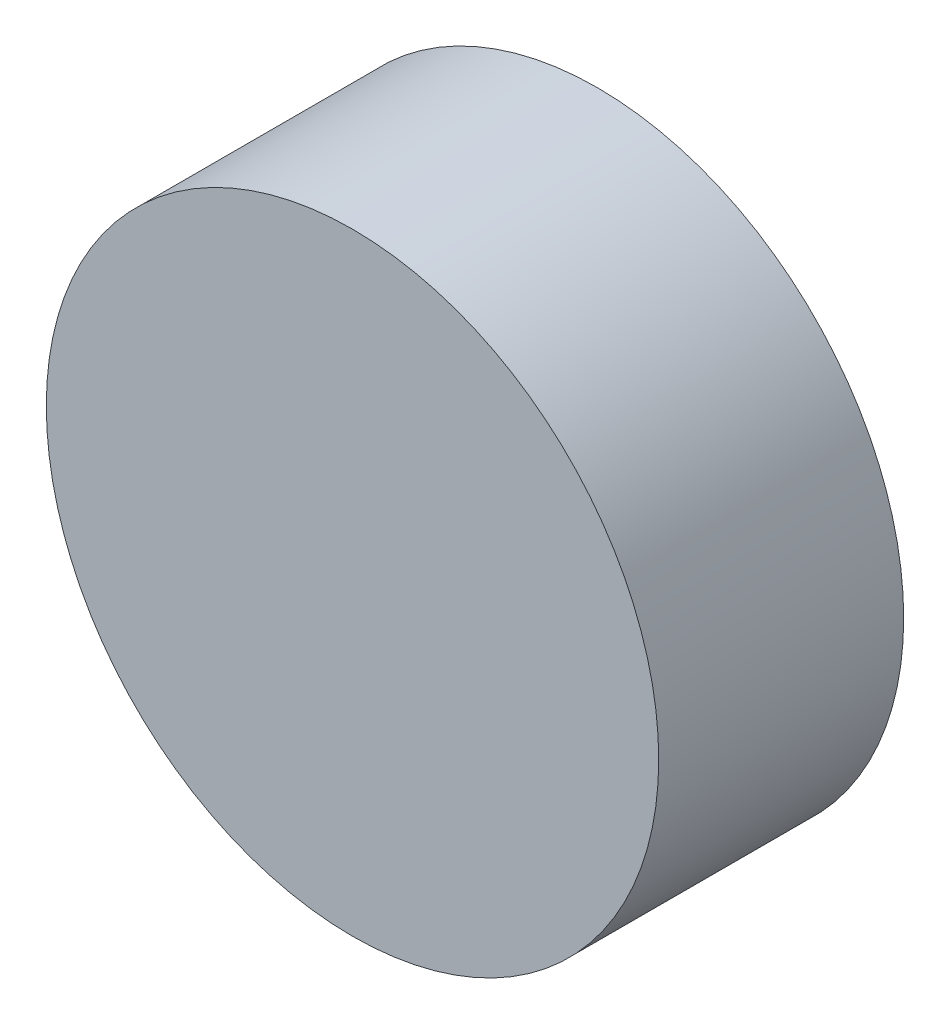
ISO-10303-21;
HEADER;
FILE_DESCRIPTION(('STEP AP214'),'2;1');
FILE_NAME('part.step','',(''),(''),'','','');
FILE_SCHEMA(('AUTOMOTIVE_DESIGN { 1 0 10303 214 1 1 1 1 }'));
ENDSEC;
DATA;
#1=APPLICATION_CONTEXT('core data for automotive mechanical design processes');
#2=APPLICATION_PROTOCOL_DEFINITION('international standard','automotive_design',2000,#1);
#3=PRODUCT_CONTEXT('',#1,'mechanical');
#4=PRODUCT('Part','Part','',(#3));
#5=PRODUCT_RELATED_PRODUCT_CATEGORY('part','',(#4));
#6=PRODUCT_DEFINITION_FORMATION('','',#4);
#7=PRODUCT_DEFINITION_CONTEXT('part definition',#1,'design');
#8=PRODUCT_DEFINITION('design','',#6,#7);
#9=PRODUCT_DEFINITION_SHAPE('','',#8);
#10=(LENGTH_UNIT() NAMED_UNIT(*) SI_UNIT(.MILLI.,.METRE.));
#11=(NAMED_UNIT(*) PLANE_ANGLE_UNIT() SI_UNIT($,.RADIAN.));
#12=(NAMED_UNIT(*) SI_UNIT($,.STERADIAN.) SOLID_ANGLE_UNIT());
#13=UNCERTAINTY_MEASURE_WITH_UNIT(LENGTH_MEASURE(1.E-05),#10,'distance_accuracy_value','');
#14=(GEOMETRIC_REPRESENTATION_CONTEXT(3) GLOBAL_UNCERTAINTY_ASSIGNED_CONTEXT((#13)) GLOBAL_UNIT_ASSIGNED_CONTEXT((#10,
#11,#12)) REPRESENTATION_CONTEXT('',''));
#15=CARTESIAN_POINT('',(0.,0.,0.));
#16=DIRECTION('',(0.,0.,1.));
#17=DIRECTION('',(1.,0.,0.));
#18=AXIS2_PLACEMENT_3D('',#15,#16,#17);
#19=CARTESIAN_POINT('',(0.,0.,40.));
#20=DIRECTION('',(0.,0.,-1.));
#21=DIRECTION('',(-1.,0.,0.));
#22=AXIS2_PLACEMENT_3D('',#19,#20,#21);
#23=CYLINDRICAL_SURFACE('',#22,50.);
#24=CARTESIAN_POINT('',(0.,0.,40.));
#25=DIRECTION('',(0.,0.,1.));
#26=DIRECTION('',(1.,0.,0.));
#27=AXIS2_PLACEMENT_3D('',#24,#25,#26);
#28=CIRCLE('',#27,50.);
#29=CARTESIAN_POINT('',(50.,0.,40.));
#30=VERTEX_POINT('',#29);
#31=EDGE_CURVE('E10',#30,#30,#28,.T.);
#32=ORIENTED_EDGE('',*,*,#31,.F.);
#33=EDGE_LOOP('',(#32));
#34=FACE_BOUND('',#33,.T.);
#35=CARTESIAN_POINT('',(0.,0.,0.));
#36=DIRECTION('',(0.,0.,1.));
#37=DIRECTION('',(1.,0.,0.));
#38=AXIS2_PLACEMENT_3D('',#35,#36,#37);
#39=CIRCLE('',#38,50.);
#40=CARTESIAN_POINT('',(50.,0.,0.));
#41=VERTEX_POINT('',#40);
#42=EDGE_CURVE('E34',#41,#41,#39,.T.);
#43=ORIENTED_EDGE('',*,*,#42,.T.);
#44=EDGE_LOOP('',(#43));
#45=FACE_BOUND('',#44,.T.);
#46=ADVANCED_FACE('F31',(#34,#45),#23,.T.);
#47=CARTESIAN_POINT('',(0.,0.,40.));
#48=DIRECTION('',(0.,0.,1.));
#49=DIRECTION('',(1.,0.,0.));
#50=AXIS2_PLACEMENT_3D('',#47,#48,#49);
#51=PLANE('',#50);
#52=ORIENTED_EDGE('',*,*,#31,.T.);
#53=EDGE_LOOP('',(#52));
#54=FACE_BOUND('',#53,.T.);
#55=ADVANCED_FACE('F46',(#54),#51,.T.);
#56=CARTESIAN_POINT('',(0.,0.,0.));
#57=DIRECTION('',(0.,0.,1.));
#58=DIRECTION('',(1.,0.,0.));
#59=AXIS2_PLACEMENT_3D('',#56,#57,#58);
#60=PLANE('',#59);
#61=ORIENTED_EDGE('',*,*,#42,.F.);
#62=EDGE_LOOP('',(#61));
#63=FACE_BOUND('',#62,.T.);
#64=ADVANCED_FACE('F44',(#63),#60,.F.);
#65=CLOSED_SHELL('',(#46,#55,#64));
#66=MANIFOLD_SOLID_BREP('B2',#65);
#67=ADVANCED_BREP_SHAPE_REPRESENTATION('',(#18,#66),#14);
#68=SHAPE_DEFINITION_REPRESENTATION(#9,#67);
ENDSEC;
END-ISO-10303-21;
